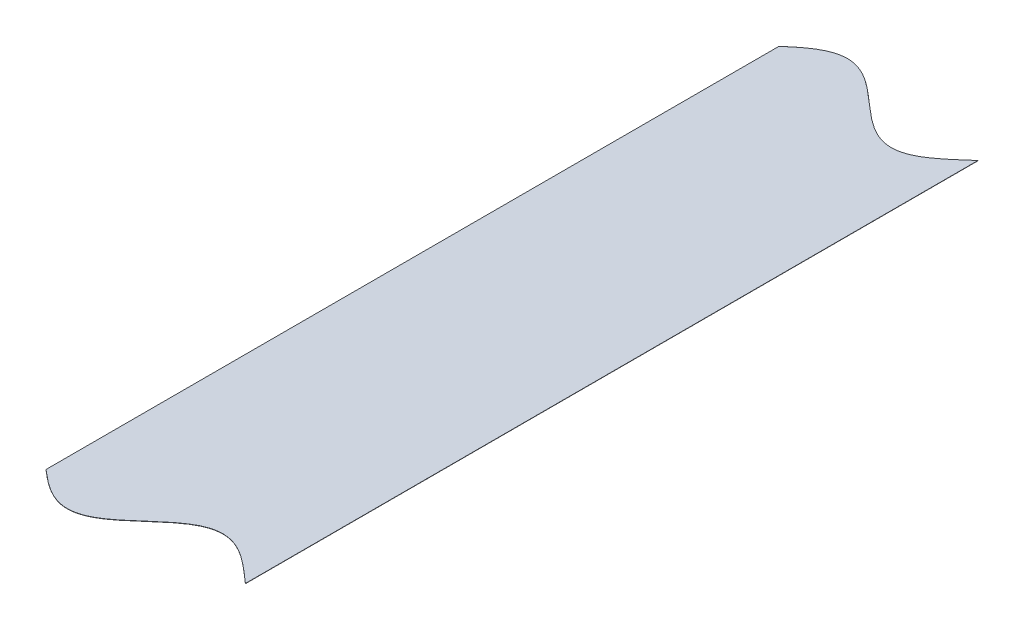
ISO-10303-21;
HEADER;
FILE_DESCRIPTION(('STEP AP214'),'2;1');
FILE_NAME('part.step','',(''),(''),'','','');
FILE_SCHEMA(('AUTOMOTIVE_DESIGN { 1 0 10303 214 1 1 1 1 }'));
ENDSEC;
DATA;
#1=APPLICATION_CONTEXT('core data for automotive mechanical design processes');
#2=APPLICATION_PROTOCOL_DEFINITION('international standard','automotive_design',2000,#1);
#3=PRODUCT_CONTEXT('',#1,'mechanical');
#4=PRODUCT('Part','Part','',(#3));
#5=PRODUCT_RELATED_PRODUCT_CATEGORY('part','',(#4));
#6=PRODUCT_DEFINITION_FORMATION('','',#4);
#7=PRODUCT_DEFINITION_CONTEXT('part definition',#1,'design');
#8=PRODUCT_DEFINITION('design','',#6,#7);
#9=PRODUCT_DEFINITION_SHAPE('','',#8);
#10=(LENGTH_UNIT() NAMED_UNIT(*) SI_UNIT(.MILLI.,.METRE.));
#11=(NAMED_UNIT(*) PLANE_ANGLE_UNIT() SI_UNIT($,.RADIAN.));
#12=(NAMED_UNIT(*) SI_UNIT($,.STERADIAN.) SOLID_ANGLE_UNIT());
#13=UNCERTAINTY_MEASURE_WITH_UNIT(LENGTH_MEASURE(1.E-05),#10,'distance_accuracy_value','');
#14=(GEOMETRIC_REPRESENTATION_CONTEXT(3) GLOBAL_UNCERTAINTY_ASSIGNED_CONTEXT((#13)) GLOBAL_UNIT_ASSIGNED_CONTEXT((#10,
#11,#12)) REPRESENTATION_CONTEXT('',''));
#15=CARTESIAN_POINT('',(0.,0.,0.));
#16=DIRECTION('',(0.,0.,1.));
#17=DIRECTION('',(1.,0.,0.));
#18=AXIS2_PLACEMENT_3D('',#15,#16,#17);
#19=CARTESIAN_POINT('',(2433.06833114507,152.546692335833,146.059298135255));
#20=DIRECTION('',(-0.999992126449225,-0.00396825396823197,0.));
#21=DIRECTION('',(0.00396825396823197,-0.999992126449226,0.));
#22=AXIS2_PLACEMENT_3D('',#19,#20,#21);
#23=PLANE('',#22);
#24=DIRECTION('',(0.,0.,-1.));
#25=VECTOR('',#24,1.);
#26=CARTESIAN_POINT('',(2433.06872797047,152.446693123188,146.059298135255));
#27=LINE('',#26,#25);
#28=CARTESIAN_POINT('',(2433.06872797047,152.446693123188,146.059298135255));
#29=VERTEX_POINT('',#28);
#30=CARTESIAN_POINT('',(2433.06872797047,152.446693123188,-146.059298135255));
#31=VERTEX_POINT('',#30);
#32=EDGE_CURVE('E110',#29,#31,#27,.T.);
#33=ORIENTED_EDGE('',*,*,#32,.F.);
#34=DIRECTION('',(0.00396825396823197,-0.999992126449225,0.));
#35=VECTOR('',#34,1.);
#36=CARTESIAN_POINT('',(2433.06833114507,152.546692335833,146.059298135255));
#37=LINE('',#36,#35);
#38=CARTESIAN_POINT('',(2433.06833114507,152.546692335833,146.059298135255));
#39=VERTEX_POINT('',#38);
#40=EDGE_CURVE('E13',#39,#29,#37,.T.);
#41=ORIENTED_EDGE('',*,*,#40,.F.);
#42=DIRECTION('',(0.,0.,-1.));
#43=VECTOR('',#42,1.);
#44=CARTESIAN_POINT('',(2433.06833114507,152.546692335833,146.059298135255));
#45=LINE('',#44,#43);
#46=CARTESIAN_POINT('',(2433.06833114507,152.546692335833,-146.059298135255));
#47=VERTEX_POINT('',#46);
#48=EDGE_CURVE('E89',#39,#47,#45,.T.);
#49=ORIENTED_EDGE('',*,*,#48,.T.);
#50=DIRECTION('',(0.00396825396823197,-0.999992126449225,0.));
#51=VECTOR('',#50,1.);
#52=CARTESIAN_POINT('',(2433.06833114507,152.546692335833,-146.059298135255));
#53=LINE('',#52,#51);
#54=EDGE_CURVE('E57',#47,#31,#53,.T.);
#55=ORIENTED_EDGE('',*,*,#54,.T.);
#56=EDGE_LOOP('',(#33,#41,#49,#55));
#57=FACE_BOUND('',#56,.T.);
#58=ADVANCED_FACE('F41',(#57),#23,.T.);
#59=CARTESIAN_POINT('',(2433.06833114507,152.546692335833,146.059298135255));
#60=CARTESIAN_POINT('',(2433.39203460942,152.547976883504,146.339387693245));
#61=CARTESIAN_POINT('',(2434.00922437365,152.550426068519,146.868573400156));
#62=CARTESIAN_POINT('',(2434.627456804,152.55287939113,147.392523089373));
#63=CARTESIAN_POINT('',(2435.24624949416,152.555334937012,147.909551831978));
#64=CARTESIAN_POINT('',(2435.86538541296,152.557791844923,148.418224379467));
#65=CARTESIAN_POINT('',(2436.48474677465,152.560249647456,148.91721323273));
#66=CARTESIAN_POINT('',(2437.42789939346,152.563992346046,149.660210570143));
#67=CARTESIAN_POINT('',(2438.66458641558,152.568899872869,150.583284851487));
#68=CARTESIAN_POINT('',(2439.90218893668,152.573811032652,151.446966974721));
#69=CARTESIAN_POINT('',(2441.14036376413,152.57872446351,152.24264463423));
#70=CARTESIAN_POINT('',(2442.37891714473,152.583639396576,152.962494973305));
#71=CARTESIAN_POINT('',(2443.61773073409,152.588555362223,153.599493462119));
#72=CARTESIAN_POINT('',(2444.8567274735,152.593472054663,154.147450697467));
#73=CARTESIAN_POINT('',(2446.09585434385,152.598389263499,154.601056326697));
#74=CARTESIAN_POINT('',(2447.33507284271,152.603306835943,154.955921583308));
#75=CARTESIAN_POINT('',(2448.57435347732,152.608224654959,155.208616673422));
#76=CARTESIAN_POINT('',(2449.81367230777,152.613142625548,155.356700912453));
#77=CARTESIAN_POINT('',(2451.05300852169,152.618060665119,155.398744568064));
#78=CARTESIAN_POINT('',(2452.29234271286,152.622978696663,155.334341786742));
#79=CARTESIAN_POINT('',(2453.53165531183,152.627896642523,155.164114271995));
#80=CARTESIAN_POINT('',(2454.77092502353,152.632814418194,154.889705646732));
#81=CARTESIAN_POINT('',(2456.0101269449,152.637731924854,154.513766623376));
#82=CARTESIAN_POINT('',(2457.24923003862,152.642649039338,154.039931349405));
#83=CARTESIAN_POINT('',(2458.48819331606,152.64756559899,153.472785625613));
#84=CARTESIAN_POINT('',(2459.72695966311,152.652481377167,152.817828252079));
#85=CARTESIAN_POINT('',(2460.9654451628,152.657396040861,152.081427757892));
#86=CARTESIAN_POINT('',(2462.20351928105,152.662309072077,151.270779061325));
#87=CARTESIAN_POINT('',(2463.44096495306,152.667219609438,150.393870194649));
#88=CARTESIAN_POINT('',(2464.67739060944,152.672126099087,149.459484332673));
#89=CARTESIAN_POINT('',(2465.62116304499,152.675871257287,148.708688065601));
#90=CARTESIAN_POINT('',(2466.24044025012,152.678328725862,148.205470939218));
#91=CARTESIAN_POINT('',(2466.85945014203,152.680785133663,147.693118795798));
#92=CARTESIAN_POINT('',(2467.47804245095,152.683239884375,147.172996715012));
#93=CARTESIAN_POINT('',(2468.09592777051,152.685691829552,146.646611214387));
#94=CARTESIAN_POINT('',(2468.71246833326,152.68813843835,146.115790541525));
#95=CARTESIAN_POINT('',(2469.32593315694,152.690572841738,145.58333423598));
#96=CARTESIAN_POINT('',(2469.9293856921,152.69296751351,145.056612868918));
#97=CARTESIAN_POINT('',(2470.41104729776,152.694878884137,144.634847755539));
#98=CARTESIAN_POINT('',(2470.74342705158,152.696197861799,144.343597625395));
#99=CARTESIAN_POINT('',(2471.26296765054,152.698259547075,143.888256952343));
#100=CARTESIAN_POINT('',(2471.51863478437,152.699274107181,143.664565764303));
#101=CARTESIAN_POINT('',(2471.85956345799,152.700627009395,143.366276582986));
#102=CARTESIAN_POINT('',(2472.4680944697,152.703041834011,142.835991362702));
#103=CARTESIAN_POINT('',(2473.08294398335,152.705481732243,142.303647426308));
#104=CARTESIAN_POINT('',(2473.70005232978,152.707930594169,141.774091695854));
#105=CARTESIAN_POINT('',(2474.31822450033,152.710383677652,141.249649898743));
#106=CARTESIAN_POINT('',(2474.9369819289,152.712839083606,140.732005549353));
#107=CARTESIAN_POINT('',(2475.55609538043,152.715295902361,140.222606137841));
#108=CARTESIAN_POINT('',(2476.17544147101,152.717753644293,139.722785853147));
#109=CARTESIAN_POINT('',(2477.11871009672,152.721496803232,138.978265746438));
#110=CARTESIAN_POINT('',(2478.35534913193,152.726404139629,138.052980924681));
#111=CARTESIAN_POINT('',(2479.59292262846,152.731315184235,137.186722516917));
#112=CARTESIAN_POINT('',(2480.83107871612,152.736228540728,136.388135445579));
#113=CARTESIAN_POINT('',(2482.06961945104,152.741143423611,135.665074374544));
#114=CARTESIAN_POINT('',(2483.30842423867,152.746059354331,135.024596785488));
#115=CARTESIAN_POINT('',(2484.54741473659,152.750976022003,134.47292673164));
#116=CARTESIAN_POINT('',(2485.78653715446,152.75589321317,134.015411000556));
#117=CARTESIAN_POINT('',(2487.02575255634,152.760810773324,133.656476407964));
#118=CARTESIAN_POINT('',(2488.26503117445,152.765728584339,133.399592200171));
#119=CARTESIAN_POINT('',(2489.50434886958,152.770646550422,133.247239577122));
#120=CARTESIAN_POINT('',(2490.74368476157,152.775564588716,133.200889496534));
#121=CARTESIAN_POINT('',(2491.98301941002,152.780482622074,133.260989385541));
#122=CARTESIAN_POINT('',(2492.6168137587,152.782997698816,133.345867524293));
#123=CARTESIAN_POINT('',(2493.2466665187,152.78549713421,133.431301477179));
#124=CARTESIAN_POINT('',(2494.48437056915,152.79040869689,133.703153024458));
#125=CARTESIAN_POINT('',(2495.7220077791,152.795319994329,134.076347493616));
#126=CARTESIAN_POINT('',(2496.95954748812,152.800230904856,134.547286529921));
#127=CARTESIAN_POINT('',(2498.19694925001,152.80514126797,135.111424126913));
#128=CARTESIAN_POINT('',(2499.43415681295,152.810050860447,135.763304914269));
#129=CARTESIAN_POINT('',(2500.67108771262,152.814959355045,136.496607118566));
#130=CARTESIAN_POINT('',(2501.90761392608,152.819866243732,137.304185743805));
#131=CARTESIAN_POINT('',(2503.14352331942,152.824770684702,138.178106363334));
#132=CARTESIAN_POINT('',(2504.37843417718,152.829671163198,139.109644729088));
#133=CARTESIAN_POINT('',(2505.32089788465,152.833411127991,139.858279156107));
#134=CARTESIAN_POINT('',(2505.93940724619,152.835865549545,140.36020268921));
#135=CARTESIAN_POINT('',(2506.55765830433,152.838318946076,140.87132785018));
#136=CARTESIAN_POINT('',(2507.17550735711,152.840770747336,141.390301455791));
#137=CARTESIAN_POINT('',(2507.79268031602,152.843219865662,141.915636422669));
#138=CARTESIAN_POINT('',(2508.40858239197,152.845663940763,142.445548012126));
#139=CARTESIAN_POINT('',(2509.02162905412,152.848096684767,142.977370748881));
#140=CARTESIAN_POINT('',(2509.62573189821,152.85049393715,143.504482679471));
#141=CARTESIAN_POINT('',(2510.10726335301,152.852404791301,143.92606702968));
#142=CARTESIAN_POINT('',(2510.2817705147,152.85309728549,144.078969811701));
#143=CARTESIAN_POINT('',(2510.35454147403,152.853386061412,144.14273156236));
#144=CARTESIAN_POINT('',(2510.98817467644,152.855900498679,144.698024236801));
#145=CARTESIAN_POINT('',(2511.21084165466,152.856784104756,144.892884109576));
#146=CARTESIAN_POINT('',(2511.55283678661,152.858141238981,145.192170193368));
#147=CARTESIAN_POINT('',(2512.15967662089,152.860549352522,145.721198212939));
#148=CARTESIAN_POINT('',(2512.44960317461,152.861699863778,145.972374108263));
#149=B_SPLINE_CURVE_WITH_KNOTS('',2,(#59,#60,#61,#62,#63,#64,#65,#66,#67,#68,#69,#70,#71,#72,
#73,#74,#75,#76,#77,#78,#79,#80,#81,#82,#83,#84,#85,#86,#87,#88,#89,#90,#91,#92,#93,#94,#95,#96,
#97,#98,#99,#100,#101,#102,#103,#104,#105,#106,#107,#108,#109,#110,#111,#112,#113,#114,#115,
#116,#117,#118,#119,#120,#121,#122,#123,#124,#125,#126,#127,#128,#129,#130,#131,#132,#133,#134,
#135,#136,#137,#138,#139,#140,#141,#142,#143,#144,#145,#146,#147,#148),.UNSPECIFIED.,.F.,.F.,(3,
1,1,1,1,1,1,1,1,1,1,1,1,1,1,1,1,1,1,1,1,1,1,1,1,1,1,1,1,1,1,1,1,1,1,1,1,1,1,1,2,1,1,1,1,1,1,1,1,
1,1,1,1,1,1,1,1,1,1,1,1,1,1,1,1,1,1,1,1,1,1,1,1,1,1,1,1,1,1,1,1,2,1,2,1,3),(0.,0.0078125,
0.015625,0.0234375,0.03125,0.0390625,0.046875,0.0625,0.078125,0.09375,0.109375,0.125,0.140625,
0.15625,0.171875,0.1875,0.203125,0.21875,0.234375,0.25,0.265625,0.28125,0.296875,0.3125,
0.328125,0.34375,0.359375,0.375,0.390625,0.40625,0.4140625,0.421875,0.4296875,0.4375,0.4453125,
0.453125,0.4609375,0.46875,0.47265625,0.4765625,0.484375,0.4921875,0.5,0.5078125,0.515625,
0.5234375,0.53125,0.5390625,0.546875,0.5625,0.578125,0.59375,0.609375,0.625,0.640625,0.65625,
0.671875,0.6875,0.703125,0.71875,0.734375,0.75,0.750316619873047,0.765921831130981,
0.781527042388916,0.797132253646851,0.812737464904785,0.82834267616272,0.843947887420654,
0.859553098678589,0.875158309936523,0.890763521194458,0.906368732452393,0.91417133808136,
0.921973943710327,0.929776549339294,0.937579154968262,0.945381760597229,0.953184366226196,
0.960986971855164,0.968789577484131,0.972690880298615,0.976592183113098,0.984394788742065,
0.992197394371033,1.),.UNSPECIFIED.);
#150=DIRECTION('',(0.00396825396823197,-0.999992126449225,0.));
#151=VECTOR('',#150,1.);
#152=SURFACE_OF_LINEAR_EXTRUSION('',#149,#151);
#153=CARTESIAN_POINT('',(2433.06872797047,152.446693123188,146.059298135255));
#154=CARTESIAN_POINT('',(2433.39243143482,152.447977670859,146.339387693245));
#155=CARTESIAN_POINT('',(2434.00962119904,152.450426855874,146.868573400156));
#156=CARTESIAN_POINT('',(2434.62785362939,152.452880178485,147.392523089373));
#157=CARTESIAN_POINT('',(2435.24664631956,152.455335724367,147.909551831978));
#158=CARTESIAN_POINT('',(2435.86578223836,152.457792632278,148.418224379467));
#159=CARTESIAN_POINT('',(2436.48514360005,152.460250434811,148.91721323273));
#160=CARTESIAN_POINT('',(2437.42829621885,152.463993133401,149.660210570143));
#161=CARTESIAN_POINT('',(2438.66498324098,152.468900660224,150.583284851487));
#162=CARTESIAN_POINT('',(2439.90258576207,152.473811820007,151.446966974721));
#163=CARTESIAN_POINT('',(2441.14076058953,152.478725250865,152.24264463423));
#164=CARTESIAN_POINT('',(2442.37931397012,152.483640183931,152.962494973305));
#165=CARTESIAN_POINT('',(2443.61812755949,152.488556149578,153.599493462119));
#166=CARTESIAN_POINT('',(2444.8571242989,152.493472842018,154.147450697467));
#167=CARTESIAN_POINT('',(2446.09625116925,152.498390050854,154.601056326697));
#168=CARTESIAN_POINT('',(2447.3354696681,152.503307623298,154.955921583308));
#169=CARTESIAN_POINT('',(2448.57475030271,152.508225442314,155.208616673422));
#170=CARTESIAN_POINT('',(2449.81406913316,152.513143412903,155.356700912453));
#171=CARTESIAN_POINT('',(2451.05340534708,152.518061452474,155.398744568064));
#172=CARTESIAN_POINT('',(2452.29273953826,152.522979484018,155.334341786742));
#173=CARTESIAN_POINT('',(2453.53205213722,152.527897429878,155.164114271995));
#174=CARTESIAN_POINT('',(2454.77132184893,152.532815205549,154.889705646732));
#175=CARTESIAN_POINT('',(2456.0105237703,152.537732712209,154.513766623376));
#176=CARTESIAN_POINT('',(2457.24962686402,152.542649826693,154.039931349405));
#177=CARTESIAN_POINT('',(2458.48859014146,152.547566386345,153.472785625613));
#178=CARTESIAN_POINT('',(2459.7273564885,152.552482164522,152.817828252079));
#179=CARTESIAN_POINT('',(2460.9658419882,152.557396828216,152.081427757892));
#180=CARTESIAN_POINT('',(2462.20391610645,152.562309859432,151.270779061325));
#181=CARTESIAN_POINT('',(2463.44136177846,152.567220396793,150.393870194649));
#182=CARTESIAN_POINT('',(2464.67778743483,152.572126886442,149.459484332673));
#183=CARTESIAN_POINT('',(2465.62155987039,152.575872044642,148.708688065601));
#184=CARTESIAN_POINT('',(2466.24083707552,152.578329513217,148.205470939218));
#185=CARTESIAN_POINT('',(2466.85984696742,152.580785921018,147.693118795798));
#186=CARTESIAN_POINT('',(2467.47843927635,152.58324067173,147.172996715012));
#187=CARTESIAN_POINT('',(2468.09632459591,152.585692616907,146.646611214387));
#188=CARTESIAN_POINT('',(2468.71286515866,152.588139225705,146.115790541525));
#189=CARTESIAN_POINT('',(2469.32632998234,152.590573629093,145.58333423598));
#190=CARTESIAN_POINT('',(2469.9297825175,152.592968300865,145.056612868918));
#191=CARTESIAN_POINT('',(2470.41144412315,152.594879671492,144.634847755539));
#192=CARTESIAN_POINT('',(2470.74382387698,152.596198649154,144.343597625395));
#193=CARTESIAN_POINT('',(2471.26336447594,152.59826033443,143.888256952343));
#194=CARTESIAN_POINT('',(2471.51903160977,152.599274894536,143.664565764303));
#195=CARTESIAN_POINT('',(2471.85996028339,152.600627796751,143.366276582986));
#196=CARTESIAN_POINT('',(2472.4684912951,152.603042621366,142.835991362702));
#197=CARTESIAN_POINT('',(2473.08334080874,152.605482519599,142.303647426308));
#198=CARTESIAN_POINT('',(2473.70044915518,152.607931381524,141.774091695854));
#199=CARTESIAN_POINT('',(2474.31862132573,152.610384465007,141.249649898743));
#200=CARTESIAN_POINT('',(2474.93737875429,152.612839870961,140.732005549353));
#201=CARTESIAN_POINT('',(2475.55649220583,152.615296689716,140.222606137841));
#202=CARTESIAN_POINT('',(2476.17583829641,152.617754431649,139.722785853147));
#203=CARTESIAN_POINT('',(2477.11910692212,152.621497590587,138.978265746438));
#204=CARTESIAN_POINT('',(2478.35574595733,152.626404926984,138.052980924681));
#205=CARTESIAN_POINT('',(2479.59331945386,152.63131597159,137.186722516917));
#206=CARTESIAN_POINT('',(2480.83147554152,152.636229328083,136.388135445579));
#207=CARTESIAN_POINT('',(2482.07001627643,152.641144210967,135.665074374544));
#208=CARTESIAN_POINT('',(2483.30882106407,152.646060141686,135.024596785488));
#209=CARTESIAN_POINT('',(2484.54781156198,152.650976809358,134.47292673164));
#210=CARTESIAN_POINT('',(2485.78693397985,152.655894000525,134.015411000556));
#211=CARTESIAN_POINT('',(2487.02614938174,152.66081156068,133.656476407964));
#212=CARTESIAN_POINT('',(2488.26542799985,152.665729371694,133.399592200171));
#213=CARTESIAN_POINT('',(2489.50474569498,152.670647337777,133.247239577122));
#214=CARTESIAN_POINT('',(2490.74408158697,152.675565376071,133.200889496534));
#215=CARTESIAN_POINT('',(2491.98341623542,152.680483409429,133.260989385541));
#216=CARTESIAN_POINT('',(2492.6172105841,152.682998486171,133.345867524293));
#217=CARTESIAN_POINT('',(2493.2470633441,152.685497921565,133.431301477179));
#218=CARTESIAN_POINT('',(2494.48476739455,152.690409484245,133.703153024458));
#219=CARTESIAN_POINT('',(2495.7224046045,152.695320781684,134.076347493616));
#220=CARTESIAN_POINT('',(2496.95994431352,152.700231692211,134.547286529921));
#221=CARTESIAN_POINT('',(2498.19734607541,152.705142055325,135.111424126913));
#222=CARTESIAN_POINT('',(2499.43455363835,152.710051647802,135.763304914269));
#223=CARTESIAN_POINT('',(2500.67148453802,152.7149601424,136.496607118566));
#224=CARTESIAN_POINT('',(2501.90801075148,152.719867031088,137.304185743805));
#225=CARTESIAN_POINT('',(2503.14392014481,152.724771472057,138.178106363334));
#226=CARTESIAN_POINT('',(2504.37883100258,152.729671950553,139.109644729088));
#227=CARTESIAN_POINT('',(2505.32129471005,152.733411915346,139.858279156107));
#228=CARTESIAN_POINT('',(2505.93980407158,152.7358663369,140.36020268921));
#229=CARTESIAN_POINT('',(2506.55805512973,152.738319733431,140.87132785018));
#230=CARTESIAN_POINT('',(2507.1759041825,152.740771534691,141.390301455791));
#231=CARTESIAN_POINT('',(2507.79307714142,152.743220653017,141.915636422669));
#232=CARTESIAN_POINT('',(2508.40897921737,152.745664728118,142.445548012126));
#233=CARTESIAN_POINT('',(2509.02202587952,152.748097472122,142.977370748881));
#234=CARTESIAN_POINT('',(2509.62612872361,152.750494724505,143.504482679471));
#235=CARTESIAN_POINT('',(2510.10766017841,152.752405578656,143.92606702968));
#236=CARTESIAN_POINT('',(2510.2821673401,152.753098072845,144.078969811701));
#237=CARTESIAN_POINT('',(2510.35493829943,152.753386848767,144.14273156236));
#238=CARTESIAN_POINT('',(2510.98857150183,152.755901286034,144.698024236801));
#239=CARTESIAN_POINT('',(2511.21123848006,152.756784892111,144.892884109576));
#240=CARTESIAN_POINT('',(2511.55323361201,152.758142026336,145.192170193368));
#241=CARTESIAN_POINT('',(2512.16007344629,152.760550139877,145.721198212939));
#242=CARTESIAN_POINT('',(2512.45,152.761700651133,145.972374108263));
#243=B_SPLINE_CURVE_WITH_KNOTS('',2,(#153,#154,#155,#156,#157,#158,#159,#160,#161,#162,#163,
#164,#165,#166,#167,#168,#169,#170,#171,#172,#173,#174,#175,#176,#177,#178,#179,#180,#181,#182,
#183,#184,#185,#186,#187,#188,#189,#190,#191,#192,#193,#194,#195,#196,#197,#198,#199,#200,#201,
#202,#203,#204,#205,#206,#207,#208,#209,#210,#211,#212,#213,#214,#215,#216,#217,#218,#219,#220,
#221,#222,#223,#224,#225,#226,#227,#228,#229,#230,#231,#232,#233,#234,#235,#236,#237,#238,#239,
#240,#241,#242),.UNSPECIFIED.,.F.,.F.,(3,1,1,1,1,1,1,1,1,1,1,1,1,1,1,1,1,1,1,1,1,1,1,1,1,1,1,1,
1,1,1,1,1,1,1,1,1,1,1,1,2,1,1,1,1,1,1,1,1,1,1,1,1,1,1,1,1,1,1,1,1,1,1,1,1,1,1,1,1,1,1,1,1,1,1,1,
1,1,1,1,1,2,1,2,1,3),(0.,0.0078125,0.015625,0.0234375,0.03125,0.0390625,0.046875,0.0625,
0.078125,0.09375,0.109375,0.125,0.140625,0.15625,0.171875,0.1875,0.203125,0.21875,0.234375,0.25,
0.265625,0.28125,0.296875,0.3125,0.328125,0.34375,0.359375,0.375,0.390625,0.40625,0.4140625,
0.421875,0.4296875,0.4375,0.4453125,0.453125,0.4609375,0.46875,0.47265625,0.4765625,0.484375,
0.4921875,0.5,0.5078125,0.515625,0.5234375,0.53125,0.5390625,0.546875,0.5625,0.578125,0.59375,
0.609375,0.625,0.640625,0.65625,0.671875,0.6875,0.703125,0.71875,0.734375,0.75,
0.750316619873047,0.765921831130981,0.781527042388916,0.797132253646851,0.812737464904785,
0.82834267616272,0.843947887420654,0.859553098678589,0.875158309936523,0.890763521194458,
0.906368732452393,0.91417133808136,0.921973943710327,0.929776549339294,0.937579154968262,
0.945381760597229,0.953184366226196,0.960986971855164,0.968789577484131,0.972690880298615,
0.976592183113098,0.984394788742065,0.992197394371033,1.),.UNSPECIFIED.);
#244=CARTESIAN_POINT('',(2512.45,152.761700651133,145.972374108263));
#245=VERTEX_POINT('',#244);
#246=EDGE_CURVE('E95',#29,#245,#243,.T.);
#247=ORIENTED_EDGE('',*,*,#246,.T.);
#248=DIRECTION('',(0.00396825396823197,-0.999992126449225,0.));
#249=VECTOR('',#248,1.);
#250=CARTESIAN_POINT('',(2512.44960317461,152.861699863778,145.972374108263));
#251=LINE('',#250,#249);
#252=CARTESIAN_POINT('',(2512.44960317461,152.861699863778,145.972374108263));
#253=VERTEX_POINT('',#252);
#254=EDGE_CURVE('E49',#253,#245,#251,.T.);
#255=ORIENTED_EDGE('',*,*,#254,.F.);
#256=EDGE_CURVE('E83',#39,#253,#149,.T.);
#257=ORIENTED_EDGE('',*,*,#256,.F.);
#258=ORIENTED_EDGE('',*,*,#40,.T.);
#259=EDGE_LOOP('',(#247,#255,#257,#258));
#260=FACE_BOUND('',#259,.T.);
#261=ADVANCED_FACE('F93',(#260),#152,.F.);
#262=CARTESIAN_POINT('',(2512.44960317461,152.861699863778,145.972374108263));
#263=DIRECTION('',(-0.999992126449225,-0.00396825396823197,0.));
#264=DIRECTION('',(0.00396825396823197,-0.999992126449226,0.));
#265=AXIS2_PLACEMENT_3D('',#262,#263,#264);
#266=PLANE('',#265);
#267=DIRECTION('',(0.,0.,-1.));
#268=VECTOR('',#267,1.);
#269=CARTESIAN_POINT('',(2512.45,152.761700651133,145.972374108263));
#270=LINE('',#269,#268);
#271=CARTESIAN_POINT('',(2512.45,152.761700651133,-145.972374108263));
#272=VERTEX_POINT('',#271);
#273=EDGE_CURVE('E131',#245,#272,#270,.T.);
#274=ORIENTED_EDGE('',*,*,#273,.T.);
#275=DIRECTION('',(0.00396825396823197,-0.999992126449225,0.));
#276=VECTOR('',#275,1.);
#277=CARTESIAN_POINT('',(2512.44960317461,152.861699863778,-145.972374108263));
#278=LINE('',#277,#276);
#279=CARTESIAN_POINT('',(2512.44960317461,152.861699863778,-145.972374108263));
#280=VERTEX_POINT('',#279);
#281=EDGE_CURVE('E71',#280,#272,#278,.T.);
#282=ORIENTED_EDGE('',*,*,#281,.F.);
#283=DIRECTION('',(0.,0.,-1.));
#284=VECTOR('',#283,1.);
#285=CARTESIAN_POINT('',(2512.44960317461,152.861699863778,145.972374108263));
#286=LINE('',#285,#284);
#287=EDGE_CURVE('E88',#253,#280,#286,.T.);
#288=ORIENTED_EDGE('',*,*,#287,.F.);
#289=ORIENTED_EDGE('',*,*,#254,.T.);
#290=EDGE_LOOP('',(#274,#282,#288,#289));
#291=FACE_BOUND('',#290,.T.);
#292=ADVANCED_FACE('F98',(#291),#266,.F.);
#293=CARTESIAN_POINT('',(2433.06833114507,152.546692335833,-146.059298135255));
#294=CARTESIAN_POINT('',(2433.39203460935,152.547976883504,-146.339387693304));
#295=CARTESIAN_POINT('',(2434.00922437452,152.550426068522,-146.868573400775));
#296=CARTESIAN_POINT('',(2434.62745679173,152.552879391081,-147.392523079105));
#297=CARTESIAN_POINT('',(2435.24624960921,152.555334937469,-147.909551928127));
#298=CARTESIAN_POINT('',(2435.86538553368,152.557791845402,-148.418224476941));
#299=CARTESIAN_POINT('',(2436.48474678191,152.560249647485,-148.917213238348));
#300=CARTESIAN_POINT('',(2437.42789938285,152.563992346004,-149.660210562));
#301=CARTESIAN_POINT('',(2438.6645864101,152.568899872847,-150.583284847631));
#302=CARTESIAN_POINT('',(2439.90218893608,152.57381103265,-151.446966974341));
#303=CARTESIAN_POINT('',(2441.14036376176,152.578724463501,-152.242644632707));
#304=CARTESIAN_POINT('',(2442.37891713574,152.58363939654,-152.962494968234));
#305=CARTESIAN_POINT('',(2443.61773072766,152.588555362198,-153.599493459276));
#306=CARTESIAN_POINT('',(2444.85672748079,152.593472054692,-154.147450700688));
#307=CARTESIAN_POINT('',(2446.09585434604,152.598389263507,-154.601056326935));
#308=CARTESIAN_POINT('',(2447.33507284122,152.603306835937,-154.955921583275));
#309=CARTESIAN_POINT('',(2448.57435348057,152.608224654972,-155.208616673812));
#310=CARTESIAN_POINT('',(2449.81367230466,152.613142625535,-155.35670091208));
#311=CARTESIAN_POINT('',(2451.05300851859,152.618060665106,-155.398744568228));
#312=CARTESIAN_POINT('',(2452.2923427152,152.622978696672,-155.334341786618));
#313=CARTESIAN_POINT('',(2453.53165531975,152.627896642554,-155.164114270711));
#314=CARTESIAN_POINT('',(2454.77092502835,152.632814418213,-154.889705645199));
#315=CARTESIAN_POINT('',(2456.01012694289,152.637731924846,-154.513766624056));
#316=CARTESIAN_POINT('',(2457.24923003172,152.64264903931,-154.039931352133));
#317=CARTESIAN_POINT('',(2458.48819330857,152.647565598961,-153.472785629466));
#318=CARTESIAN_POINT('',(2459.72695965799,152.652481377147,-152.817828254891));
#319=CARTESIAN_POINT('',(2460.96544515855,152.657396040845,-152.081427760648));
#320=CARTESIAN_POINT('',(2462.20351922643,152.66230907186,-151.270779097118));
#321=CARTESIAN_POINT('',(2463.44096488741,152.667219609178,-150.393870243958));
#322=CARTESIAN_POINT('',(2464.6773905903,152.672126099011,-149.459484347424));
#323=CARTESIAN_POINT('',(2465.62116303417,152.675871257244,-148.708688074433));
#324=CARTESIAN_POINT('',(2466.24044024492,152.678328725842,-148.205470943406));
#325=CARTESIAN_POINT('',(2466.85945013065,152.680785133618,-147.69311880533));
#326=CARTESIAN_POINT('',(2467.4780424441,152.683239884348,-147.172996720807));
#327=CARTESIAN_POINT('',(2468.09592776632,152.685691829535,-146.646611217993));
#328=CARTESIAN_POINT('',(2468.71246832723,152.688138438326,-146.115790546717));
#329=CARTESIAN_POINT('',(2469.32593312421,152.690572841608,-145.583334264429));
#330=CARTESIAN_POINT('',(2469.9293855644,152.692967513003,-145.056612980488));
#331=CARTESIAN_POINT('',(2470.41104706835,152.694878883226,-144.63484795652));
#332=CARTESIAN_POINT('',(2470.74342705158,152.696197861799,-144.343597625432));
#333=CARTESIAN_POINT('',(2471.26296757057,152.698259546758,-143.888257022346));
#334=CARTESIAN_POINT('',(2471.51863478437,152.699274107181,-143.664565764303));
#335=CARTESIAN_POINT('',(2471.85956384013,152.700627010912,-143.366276248594));
#336=CARTESIAN_POINT('',(2472.46809451902,152.703041834206,-142.835991321363));
#337=CARTESIAN_POINT('',(2473.08294380047,152.705481731518,-142.303647583125));
#338=CARTESIAN_POINT('',(2473.70005234193,152.707930594217,-141.774091685548));
#339=CARTESIAN_POINT('',(2474.31822451299,152.710383677703,-141.249649888008));
#340=CARTESIAN_POINT('',(2474.93698182433,152.712839083191,-140.732005636988));
#341=CARTESIAN_POINT('',(2475.55609516038,152.715295901488,-140.222606317224));
#342=CARTESIAN_POINT('',(2476.17544136748,152.717753643883,-139.722785934835));
#343=CARTESIAN_POINT('',(2477.11871016028,152.721496803485,-138.978265696349));
#344=CARTESIAN_POINT('',(2478.35534919795,152.726404139891,-138.052980877963));
#345=CARTESIAN_POINT('',(2479.59292268202,152.731315184447,-137.186722479959));
#346=CARTESIAN_POINT('',(2480.83107879438,152.736228541039,-136.388135397603));
#347=CARTESIAN_POINT('',(2482.06961948773,152.741143423757,-135.665074355478));
#348=CARTESIAN_POINT('',(2483.30842423914,152.746059354333,-135.024596785342));
#349=CARTESIAN_POINT('',(2484.54741472891,152.750976021972,-134.472926734993));
#350=CARTESIAN_POINT('',(2485.78653715569,152.755893213175,-134.015410999573));
#351=CARTESIAN_POINT('',(2487.02575256078,152.760810773342,-133.656476407312));
#352=CARTESIAN_POINT('',(2488.26503116828,152.765728584314,-133.399592201181));
#353=CARTESIAN_POINT('',(2489.50434886963,152.770646550422,-133.247239576864));
#354=CARTESIAN_POINT('',(2490.74368475917,152.775564588706,-133.20088949688));
#355=CARTESIAN_POINT('',(2491.98301940506,152.780482622055,-133.260989384838));
#356=CARTESIAN_POINT('',(2492.61681375916,152.782997698818,-133.345867524354));
#357=CARTESIAN_POINT('',(2493.24666652084,152.785497134218,-133.431301477469));
#358=CARTESIAN_POINT('',(2494.48437056884,152.790408696889,-133.703153024566));
#359=CARTESIAN_POINT('',(2495.72200777948,152.795319994331,-134.076347493527));
#360=CARTESIAN_POINT('',(2496.95954749161,152.80023090487,-134.547286531476));
#361=CARTESIAN_POINT('',(2498.19694925047,152.805141267972,-135.111424127159));
#362=CARTESIAN_POINT('',(2499.43415681291,152.810050860447,-135.763304914244));
#363=CARTESIAN_POINT('',(2500.671087703,152.814959355007,-136.496607112863));
#364=CARTESIAN_POINT('',(2501.90761391141,152.819866243674,-137.304185733665));
#365=CARTESIAN_POINT('',(2503.14352330724,152.824770684654,-138.178106354503));
#366=CARTESIAN_POINT('',(2504.37843424324,152.82967116346,-139.109644778586));
#367=CARTESIAN_POINT('',(2505.32089804937,152.833411128645,-139.858279288363));
#368=CARTESIAN_POINT('',(2505.93940745267,152.835865550364,-140.360202858128));
#369=CARTESIAN_POINT('',(2506.55765844202,152.838318946623,-140.871327965718));
#370=CARTESIAN_POINT('',(2507.17550737656,152.840770747413,-141.39030147224));
#371=CARTESIAN_POINT('',(2507.79268052523,152.843219866492,-141.915636600846));
#372=CARTESIAN_POINT('',(2508.4085823646,152.845663940654,-142.445547990248));
#373=CARTESIAN_POINT('',(2509.02162876778,152.84809668363,-142.977370498824));
#374=CARTESIAN_POINT('',(2509.62573191402,152.850493937212,-143.504482693436));
#375=CARTESIAN_POINT('',(2510.10726183973,152.852404785296,-143.926065704744));
#376=CARTESIAN_POINT('',(2510.2817705147,152.85309728549,-144.078969811701));
#377=CARTESIAN_POINT('',(2510.35453852663,152.853386049716,-144.142728979438));
#378=CARTESIAN_POINT('',(2510.98817463534,152.855900498516,-144.698024200669));
#379=CARTESIAN_POINT('',(2511.21084165466,152.856784104756,-144.892884109576));
#380=CARTESIAN_POINT('',(2511.55283713466,152.858141240362,-145.19217049821));
#381=CARTESIAN_POINT('',(2512.15967693295,152.86054935376,-145.72119848329));
#382=CARTESIAN_POINT('',(2512.44960317461,152.861699863778,-145.972374108263));
#383=B_SPLINE_CURVE_WITH_KNOTS('',2,(#293,#294,#295,#296,#297,#298,#299,#300,#301,#302,#303,
#304,#305,#306,#307,#308,#309,#310,#311,#312,#313,#314,#315,#316,#317,#318,#319,#320,#321,#322,
#323,#324,#325,#326,#327,#328,#329,#330,#331,#332,#333,#334,#335,#336,#337,#338,#339,#340,#341,
#342,#343,#344,#345,#346,#347,#348,#349,#350,#351,#352,#353,#354,#355,#356,#357,#358,#359,#360,
#361,#362,#363,#364,#365,#366,#367,#368,#369,#370,#371,#372,#373,#374,#375,#376,#377,#378,#379,
#380,#381,#382),.UNSPECIFIED.,.F.,.F.,(3,1,1,1,1,1,1,1,1,1,1,1,1,1,1,1,1,1,1,1,1,1,1,1,1,1,1,1,
1,1,1,1,1,1,1,1,1,1,1,1,2,1,1,1,1,1,1,1,1,1,1,1,1,1,1,1,1,1,1,1,1,1,1,1,1,1,1,1,1,1,1,1,1,1,1,1,
1,1,1,1,1,2,1,2,1,3),(0.,0.0078125,0.015625,0.0234375,0.03125,0.0390625,0.046875,0.0625,
0.078125,0.09375,0.109375,0.125,0.140625,0.15625,0.171875,0.1875,0.203125,0.21875,0.234375,0.25,
0.265625,0.28125,0.296875,0.3125,0.328125,0.34375,0.359375,0.375,0.390625,0.40625,0.4140625,
0.421875,0.4296875,0.4375,0.4453125,0.453125,0.4609375,0.46875,0.47265625,0.4765625,0.484375,
0.4921875,0.5,0.5078125,0.515625,0.5234375,0.53125,0.5390625,0.546875,0.5625,0.578125,0.59375,
0.609375,0.625,0.640625,0.65625,0.671875,0.6875,0.703125,0.71875,0.734375,0.75,
0.750316619873047,0.765921831130981,0.781527042388916,0.797132253646851,0.812737464904785,
0.82834267616272,0.843947887420654,0.859553098678589,0.875158309936523,0.890763521194458,
0.906368732452393,0.91417133808136,0.921973943710327,0.929776549339294,0.937579154968262,
0.945381760597229,0.953184366226196,0.960986971855164,0.968789577484131,0.972690880298615,
0.976592183113098,0.984394788742065,0.992197394371033,1.),.UNSPECIFIED.);
#384=DIRECTION('',(0.00396825396823197,-0.999992126449225,0.));
#385=VECTOR('',#384,1.);
#386=SURFACE_OF_LINEAR_EXTRUSION('',#383,#385);
#387=CARTESIAN_POINT('',(2433.06872797047,152.446693123188,-146.059298135255));
#388=CARTESIAN_POINT('',(2433.39243143475,152.447977670859,-146.339387693304));
#389=CARTESIAN_POINT('',(2434.00962119992,152.450426855877,-146.868573400775));
#390=CARTESIAN_POINT('',(2434.62785361713,152.452880178436,-147.392523079105));
#391=CARTESIAN_POINT('',(2435.2466464346,152.455335724824,-147.909551928127));
#392=CARTESIAN_POINT('',(2435.86578235907,152.457792632757,-148.418224476941));
#393=CARTESIAN_POINT('',(2436.48514360731,152.46025043484,-148.917213238348));
#394=CARTESIAN_POINT('',(2437.42829620824,152.463993133359,-149.660210562));
#395=CARTESIAN_POINT('',(2438.6649832355,152.468900660202,-150.583284847631));
#396=CARTESIAN_POINT('',(2439.90258576148,152.473811820005,-151.446966974341));
#397=CARTESIAN_POINT('',(2441.14076058716,152.478725250856,-152.242644632707));
#398=CARTESIAN_POINT('',(2442.37931396114,152.483640183895,-152.962494968234));
#399=CARTESIAN_POINT('',(2443.61812755306,152.488556149553,-153.599493459276));
#400=CARTESIAN_POINT('',(2444.85712430618,152.493472842047,-154.147450700688));
#401=CARTESIAN_POINT('',(2446.09625117144,152.498390050862,-154.601056326935));
#402=CARTESIAN_POINT('',(2447.33546966662,152.503307623292,-154.955921583275));
#403=CARTESIAN_POINT('',(2448.57475030597,152.508225442327,-155.208616673812));
#404=CARTESIAN_POINT('',(2449.81406913006,152.51314341289,-155.35670091208));
#405=CARTESIAN_POINT('',(2451.05340534399,152.518061452461,-155.398744568228));
#406=CARTESIAN_POINT('',(2452.2927395406,152.522979484027,-155.334341786618));
#407=CARTESIAN_POINT('',(2453.53205214515,152.527897429909,-155.164114270711));
#408=CARTESIAN_POINT('',(2454.77132185375,152.532815205568,-154.889705645199));
#409=CARTESIAN_POINT('',(2456.01052376829,152.537732712201,-154.513766624056));
#410=CARTESIAN_POINT('',(2457.24962685712,152.542649826665,-154.039931352133));
#411=CARTESIAN_POINT('',(2458.48859013397,152.547566386316,-153.472785629466));
#412=CARTESIAN_POINT('',(2459.72735648338,152.552482164502,-152.817828254891));
#413=CARTESIAN_POINT('',(2460.96584198394,152.5573968282,-152.081427760648));
#414=CARTESIAN_POINT('',(2462.20391605183,152.562309859215,-151.270779097118));
#415=CARTESIAN_POINT('',(2463.44136171281,152.567220396533,-150.393870243958));
#416=CARTESIAN_POINT('',(2464.6777874157,152.572126886366,-149.459484347424));
#417=CARTESIAN_POINT('',(2465.62155985957,152.575872044599,-148.708688074433));
#418=CARTESIAN_POINT('',(2466.24083707032,152.578329513197,-148.205470943406));
#419=CARTESIAN_POINT('',(2466.85984695604,152.580785920973,-147.69311880533));
#420=CARTESIAN_POINT('',(2467.4784392695,152.583240671703,-147.172996720807));
#421=CARTESIAN_POINT('',(2468.09632459172,152.58569261689,-146.646611217993));
#422=CARTESIAN_POINT('',(2468.71286515263,152.588139225681,-146.115790546717));
#423=CARTESIAN_POINT('',(2469.32632994961,152.590573628963,-145.583334264429));
#424=CARTESIAN_POINT('',(2469.92978238979,152.592968300358,-145.056612980488));
#425=CARTESIAN_POINT('',(2470.41144389374,152.594879670581,-144.63484795652));
#426=CARTESIAN_POINT('',(2470.74382387698,152.596198649154,-144.343597625432));
#427=CARTESIAN_POINT('',(2471.26336439597,152.598260334113,-143.888257022346));
#428=CARTESIAN_POINT('',(2471.51903160977,152.599274894536,-143.664565764303));
#429=CARTESIAN_POINT('',(2471.85996066553,152.600627798267,-143.366276248594));
#430=CARTESIAN_POINT('',(2472.46849134441,152.603042621561,-142.835991321363));
#431=CARTESIAN_POINT('',(2473.08334062587,152.605482518873,-142.303647583125));
#432=CARTESIAN_POINT('',(2473.70044916733,152.607931381572,-141.774091685548));
#433=CARTESIAN_POINT('',(2474.31862133838,152.610384465058,-141.249649888008));
#434=CARTESIAN_POINT('',(2474.93737864973,152.612839870546,-140.732005636988));
#435=CARTESIAN_POINT('',(2475.55649198577,152.615296688843,-140.222606317224));
#436=CARTESIAN_POINT('',(2476.17583819287,152.617754431238,-139.722785934835));
#437=CARTESIAN_POINT('',(2477.11910698568,152.62149759084,-138.978265696349));
#438=CARTESIAN_POINT('',(2478.35574602334,152.626404927246,-138.052980877963));
#439=CARTESIAN_POINT('',(2479.59331950742,152.631315971802,-137.186722479959));
#440=CARTESIAN_POINT('',(2480.83147561978,152.636229328394,-136.388135397603));
#441=CARTESIAN_POINT('',(2482.07001631313,152.641144211112,-135.665074355478));
#442=CARTESIAN_POINT('',(2483.30882106454,152.646060141688,-135.024596785342));
#443=CARTESIAN_POINT('',(2484.54781155431,152.650976809327,-134.472926734993));
#444=CARTESIAN_POINT('',(2485.78693398109,152.65589400053,-134.015410999573));
#445=CARTESIAN_POINT('',(2487.02614938618,152.660811560697,-133.656476407312));
#446=CARTESIAN_POINT('',(2488.26542799368,152.665729371669,-133.399592201181));
#447=CARTESIAN_POINT('',(2489.50474569502,152.670647337777,-133.247239576864));
#448=CARTESIAN_POINT('',(2490.74408158457,152.675565376061,-133.20088949688));
#449=CARTESIAN_POINT('',(2491.98341623046,152.68048340941,-133.260989384838));
#450=CARTESIAN_POINT('',(2492.61721058456,152.682998486173,-133.345867524354));
#451=CARTESIAN_POINT('',(2493.24706334623,152.685497921573,-133.431301477469));
#452=CARTESIAN_POINT('',(2494.48476739424,152.690409484244,-133.703153024566));
#453=CARTESIAN_POINT('',(2495.72240460487,152.695320781686,-134.076347493527));
#454=CARTESIAN_POINT('',(2496.95994431701,152.700231692225,-134.547286531476));
#455=CARTESIAN_POINT('',(2498.19734607587,152.705142055327,-135.111424127159));
#456=CARTESIAN_POINT('',(2499.43455363831,152.710051647802,-135.763304914244));
#457=CARTESIAN_POINT('',(2500.6714845284,152.714960142362,-136.496607112863));
#458=CARTESIAN_POINT('',(2501.90801073681,152.719867031029,-137.304185733665));
#459=CARTESIAN_POINT('',(2503.14392013264,152.724771472009,-138.178106354503));
#460=CARTESIAN_POINT('',(2504.37883106864,152.729671950815,-139.109644778586));
#461=CARTESIAN_POINT('',(2505.32129487477,152.733411916,-139.858279288363));
#462=CARTESIAN_POINT('',(2505.93980427807,152.735866337719,-140.360202858128));
#463=CARTESIAN_POINT('',(2506.55805526742,152.738319733978,-140.871327965718));
#464=CARTESIAN_POINT('',(2507.17590420195,152.740771534768,-141.39030147224));
#465=CARTESIAN_POINT('',(2507.79307735063,152.743220653848,-141.915636600846));
#466=CARTESIAN_POINT('',(2508.40897919,152.745664728009,-142.445547990248));
#467=CARTESIAN_POINT('',(2509.02202559318,152.748097470985,-142.977370498824));
#468=CARTESIAN_POINT('',(2509.62612873941,152.750494724567,-143.504482693436));
#469=CARTESIAN_POINT('',(2510.10765866513,152.752405572651,-143.926065704744));
#470=CARTESIAN_POINT('',(2510.2821673401,152.753098072845,-144.078969811701));
#471=CARTESIAN_POINT('',(2510.35493535203,152.753386837071,-144.142728979438));
#472=CARTESIAN_POINT('',(2510.98857146074,152.755901285871,-144.698024200669));
#473=CARTESIAN_POINT('',(2511.21123848006,152.756784892111,-144.892884109576));
#474=CARTESIAN_POINT('',(2511.55323396005,152.758142027717,-145.19217049821));
#475=CARTESIAN_POINT('',(2512.16007375835,152.760550141115,-145.72119848329));
#476=CARTESIAN_POINT('',(2512.45,152.761700651133,-145.972374108263));
#477=B_SPLINE_CURVE_WITH_KNOTS('',2,(#387,#388,#389,#390,#391,#392,#393,#394,#395,#396,#397,
#398,#399,#400,#401,#402,#403,#404,#405,#406,#407,#408,#409,#410,#411,#412,#413,#414,#415,#416,
#417,#418,#419,#420,#421,#422,#423,#424,#425,#426,#427,#428,#429,#430,#431,#432,#433,#434,#435,
#436,#437,#438,#439,#440,#441,#442,#443,#444,#445,#446,#447,#448,#449,#450,#451,#452,#453,#454,
#455,#456,#457,#458,#459,#460,#461,#462,#463,#464,#465,#466,#467,#468,#469,#470,#471,#472,#473,
#474,#475,#476),.UNSPECIFIED.,.F.,.F.,(3,1,1,1,1,1,1,1,1,1,1,1,1,1,1,1,1,1,1,1,1,1,1,1,1,1,1,1,
1,1,1,1,1,1,1,1,1,1,1,1,2,1,1,1,1,1,1,1,1,1,1,1,1,1,1,1,1,1,1,1,1,1,1,1,1,1,1,1,1,1,1,1,1,1,1,1,
1,1,1,1,1,2,1,2,1,3),(0.,0.0078125,0.015625,0.0234375,0.03125,0.0390625,0.046875,0.0625,
0.078125,0.09375,0.109375,0.125,0.140625,0.15625,0.171875,0.1875,0.203125,0.21875,0.234375,0.25,
0.265625,0.28125,0.296875,0.3125,0.328125,0.34375,0.359375,0.375,0.390625,0.40625,0.4140625,
0.421875,0.4296875,0.4375,0.4453125,0.453125,0.4609375,0.46875,0.47265625,0.4765625,0.484375,
0.4921875,0.5,0.5078125,0.515625,0.5234375,0.53125,0.5390625,0.546875,0.5625,0.578125,0.59375,
0.609375,0.625,0.640625,0.65625,0.671875,0.6875,0.703125,0.71875,0.734375,0.75,
0.750316619873047,0.765921831130981,0.781527042388916,0.797132253646851,0.812737464904785,
0.82834267616272,0.843947887420654,0.859553098678589,0.875158309936523,0.890763521194458,
0.906368732452393,0.91417133808136,0.921973943710327,0.929776549339294,0.937579154968262,
0.945381760597229,0.953184366226196,0.960986971855164,0.968789577484131,0.972690880298615,
0.976592183113098,0.984394788742065,0.992197394371033,1.),.UNSPECIFIED.);
#478=EDGE_CURVE('E132',#31,#272,#477,.T.);
#479=ORIENTED_EDGE('',*,*,#478,.F.);
#480=ORIENTED_EDGE('',*,*,#54,.F.);
#481=EDGE_CURVE('E99',#47,#280,#383,.T.);
#482=ORIENTED_EDGE('',*,*,#481,.T.);
#483=ORIENTED_EDGE('',*,*,#281,.T.);
#484=EDGE_LOOP('',(#479,#480,#482,#483));
#485=FACE_BOUND('',#484,.T.);
#486=ADVANCED_FACE('F116',(#485),#386,.T.);
#487=CARTESIAN_POINT('',(5431.87409892189,164.446808919266,3065.41985627353));
#488=DIRECTION('',(-0.00396825396800639,0.999992126449226,0.));
#489=DIRECTION('',(-0.999992126449226,-0.00396825396800639,0.));
#490=AXIS2_PLACEMENT_3D('',#487,#488,#489);
#491=PLANE('',#490);
#492=ORIENTED_EDGE('',*,*,#48,.F.);
#493=ORIENTED_EDGE('',*,*,#256,.T.);
#494=ORIENTED_EDGE('',*,*,#287,.T.);
#495=ORIENTED_EDGE('',*,*,#481,.F.);
#496=EDGE_LOOP('',(#492,#493,#494,#495));
#497=FACE_BOUND('',#496,.T.);
#498=ADVANCED_FACE('F85',(#497),#491,.T.);
#499=CARTESIAN_POINT('',(5431.87449574729,164.346809706621,3065.41985627353));
#500=DIRECTION('',(-0.00396825396800639,0.999992126449226,0.));
#501=DIRECTION('',(-0.999992126449226,-0.00396825396800639,0.));
#502=AXIS2_PLACEMENT_3D('',#499,#500,#501);
#503=PLANE('',#502);
#504=ORIENTED_EDGE('',*,*,#32,.T.);
#505=ORIENTED_EDGE('',*,*,#478,.T.);
#506=ORIENTED_EDGE('',*,*,#273,.F.);
#507=ORIENTED_EDGE('',*,*,#246,.F.);
#508=EDGE_LOOP('',(#504,#505,#506,#507));
#509=FACE_BOUND('',#508,.T.);
#510=ADVANCED_FACE('F120',(#509),#503,.F.);
#511=CLOSED_SHELL('',(#58,#261,#292,#486,#498,#510));
#512=MANIFOLD_SOLID_BREP('B2',#511);
#513=ADVANCED_BREP_SHAPE_REPRESENTATION('',(#18,#512),#14);
#514=SHAPE_DEFINITION_REPRESENTATION(#9,#513);
ENDSEC;
END-ISO-10303-21;
